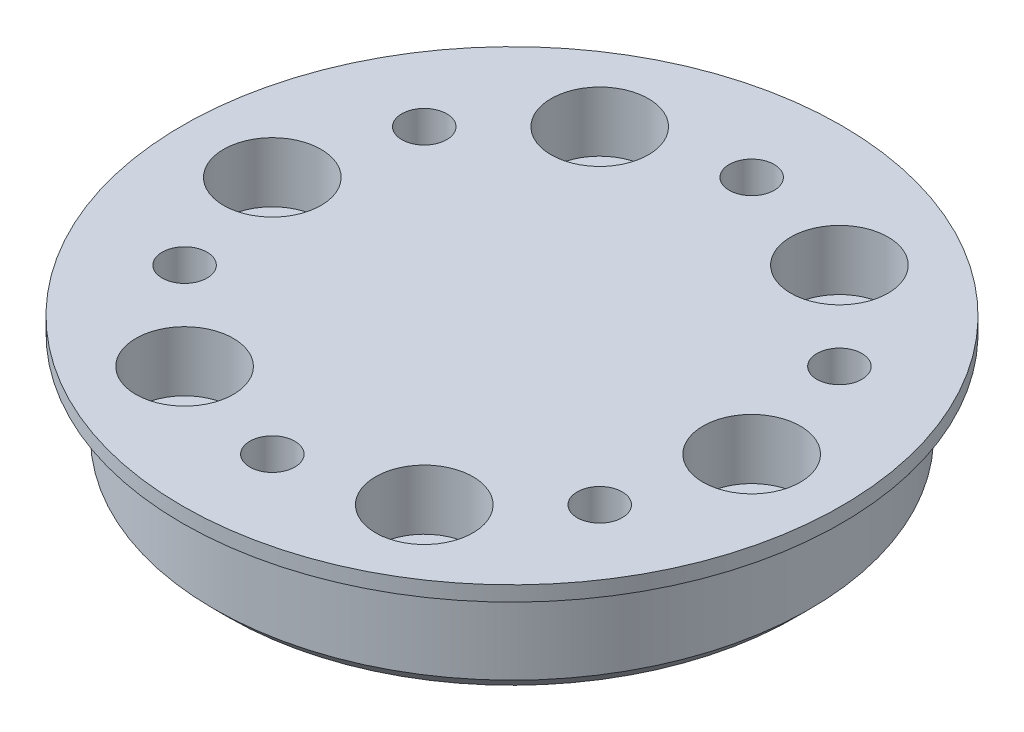
ISO-10303-21;
HEADER;
FILE_DESCRIPTION(('STEP AP214'),'2;1');
FILE_NAME('part.step','',(''),(''),'','','');
FILE_SCHEMA(('AUTOMOTIVE_DESIGN { 1 0 10303 214 1 1 1 1 }'));
ENDSEC;
DATA;
#1=APPLICATION_CONTEXT('core data for automotive mechanical design processes');
#2=APPLICATION_PROTOCOL_DEFINITION('international standard','automotive_design',2000,#1);
#3=PRODUCT_CONTEXT('',#1,'mechanical');
#4=PRODUCT('Part','Part','',(#3));
#5=PRODUCT_RELATED_PRODUCT_CATEGORY('part','',(#4));
#6=PRODUCT_DEFINITION_FORMATION('','',#4);
#7=PRODUCT_DEFINITION_CONTEXT('part definition',#1,'design');
#8=PRODUCT_DEFINITION('design','',#6,#7);
#9=PRODUCT_DEFINITION_SHAPE('','',#8);
#10=(LENGTH_UNIT() NAMED_UNIT(*) SI_UNIT(.MILLI.,.METRE.));
#11=(NAMED_UNIT(*) PLANE_ANGLE_UNIT() SI_UNIT($,.RADIAN.));
#12=(NAMED_UNIT(*) SI_UNIT($,.STERADIAN.) SOLID_ANGLE_UNIT());
#13=UNCERTAINTY_MEASURE_WITH_UNIT(LENGTH_MEASURE(1.E-05),#10,'distance_accuracy_value','');
#14=(GEOMETRIC_REPRESENTATION_CONTEXT(3) GLOBAL_UNCERTAINTY_ASSIGNED_CONTEXT((#13)) GLOBAL_UNIT_ASSIGNED_CONTEXT((#10,
#11,#12)) REPRESENTATION_CONTEXT('',''));
#15=CARTESIAN_POINT('',(0.,0.,0.));
#16=DIRECTION('',(0.,0.,1.));
#17=DIRECTION('',(1.,0.,0.));
#18=AXIS2_PLACEMENT_3D('',#15,#16,#17);
#19=CARTESIAN_POINT('',(8.00000000000002,0.,-13.856406460551));
#20=DIRECTION('',(0.,1.,0.));
#21=DIRECTION('',(0.,0.,1.));
#22=AXIS2_PLACEMENT_3D('',#19,#20,#21);
#23=CYLINDRICAL_SURFACE('',#22,1.6);
#24=CARTESIAN_POINT('',(8.00000000000002,0.,-13.856406460551));
#25=DIRECTION('',(0.,1.,0.));
#26=DIRECTION('',(0.,0.,1.));
#27=AXIS2_PLACEMENT_3D('',#24,#25,#26);
#28=CIRCLE('',#27,1.6);
#29=CARTESIAN_POINT('',(8.00000000000002,0.,-12.256406460551));
#30=VERTEX_POINT('',#29);
#31=EDGE_CURVE('E64',#30,#30,#28,.T.);
#32=ORIENTED_EDGE('',*,*,#31,.F.);
#33=EDGE_LOOP('',(#32));
#34=FACE_BOUND('',#33,.T.);
#35=CARTESIAN_POINT('',(8.00000000000002,4.,-13.856406460551));
#36=DIRECTION('',(0.,1.,0.));
#37=DIRECTION('',(0.,0.,1.));
#38=AXIS2_PLACEMENT_3D('',#35,#36,#37);
#39=CIRCLE('',#38,1.6);
#40=CARTESIAN_POINT('',(8.00000000000002,4.,-12.256406460551));
#41=VERTEX_POINT('',#40);
#42=EDGE_CURVE('E61',#41,#41,#39,.F.);
#43=ORIENTED_EDGE('',*,*,#42,.F.);
#44=EDGE_LOOP('',(#43));
#45=FACE_BOUND('',#44,.T.);
#46=ADVANCED_FACE('F42',(#34,#45),#23,.F.);
#47=CARTESIAN_POINT('',(16.0000000000007,0.,-6.79181874011743E-13));
#48=DIRECTION('',(0.,1.,0.));
#49=DIRECTION('',(0.,0.,1.));
#50=AXIS2_PLACEMENT_3D('',#47,#48,#49);
#51=CYLINDRICAL_SURFACE('',#50,1.6);
#52=CARTESIAN_POINT('',(16.0000000000007,0.,-6.79181874011743E-13));
#53=DIRECTION('',(0.,1.,0.));
#54=DIRECTION('',(0.,0.,1.));
#55=AXIS2_PLACEMENT_3D('',#52,#53,#54);
#56=CIRCLE('',#55,1.6);
#57=CARTESIAN_POINT('',(16.0000000000007,0.,1.59999999999932));
#58=VERTEX_POINT('',#57);
#59=EDGE_CURVE('E134',#58,#58,#56,.T.);
#60=ORIENTED_EDGE('',*,*,#59,.F.);
#61=EDGE_LOOP('',(#60));
#62=FACE_BOUND('',#61,.T.);
#63=CARTESIAN_POINT('',(16.0000000000007,4.,-6.79181874011743E-13));
#64=DIRECTION('',(0.,1.,0.));
#65=DIRECTION('',(0.,0.,1.));
#66=AXIS2_PLACEMENT_3D('',#63,#64,#65);
#67=CIRCLE('',#66,1.6);
#68=CARTESIAN_POINT('',(16.0000000000007,4.,1.59999999999932));
#69=VERTEX_POINT('',#68);
#70=EDGE_CURVE('E65',#69,#69,#67,.F.);
#71=ORIENTED_EDGE('',*,*,#70,.F.);
#72=EDGE_LOOP('',(#71));
#73=FACE_BOUND('',#72,.T.);
#74=ADVANCED_FACE('F217',(#62,#73),#51,.F.);
#75=CARTESIAN_POINT('',(8.00000000000127,0.,13.8564064605507));
#76=DIRECTION('',(0.,1.,0.));
#77=DIRECTION('',(0.,0.,1.));
#78=AXIS2_PLACEMENT_3D('',#75,#76,#77);
#79=CYLINDRICAL_SURFACE('',#78,1.6);
#80=CARTESIAN_POINT('',(8.00000000000127,0.,13.8564064605507));
#81=DIRECTION('',(0.,1.,0.));
#82=DIRECTION('',(0.,0.,1.));
#83=AXIS2_PLACEMENT_3D('',#80,#81,#82);
#84=CIRCLE('',#83,1.6);
#85=CARTESIAN_POINT('',(8.00000000000127,0.,15.4564064605507));
#86=VERTEX_POINT('',#85);
#87=EDGE_CURVE('E129',#86,#86,#84,.T.);
#88=ORIENTED_EDGE('',*,*,#87,.F.);
#89=EDGE_LOOP('',(#88));
#90=FACE_BOUND('',#89,.T.);
#91=CARTESIAN_POINT('',(8.00000000000127,4.,13.8564064605507));
#92=DIRECTION('',(0.,1.,0.));
#93=DIRECTION('',(0.,0.,1.));
#94=AXIS2_PLACEMENT_3D('',#91,#92,#93);
#95=CIRCLE('',#94,1.6);
#96=CARTESIAN_POINT('',(8.00000000000127,4.,15.4564064605507));
#97=VERTEX_POINT('',#96);
#98=EDGE_CURVE('E68',#97,#97,#95,.F.);
#99=ORIENTED_EDGE('',*,*,#98,.F.);
#100=EDGE_LOOP('',(#99));
#101=FACE_BOUND('',#100,.T.);
#102=ADVANCED_FACE('F223',(#90,#101),#79,.F.);
#103=CARTESIAN_POINT('',(-7.99999999999992,0.,-13.8564064605507));
#104=DIRECTION('',(0.,1.,0.));
#105=DIRECTION('',(0.,0.,1.));
#106=AXIS2_PLACEMENT_3D('',#103,#104,#105);
#107=CYLINDRICAL_SURFACE('',#106,1.6);
#108=CARTESIAN_POINT('',(-7.99999999999992,0.,-13.8564064605507));
#109=DIRECTION('',(0.,1.,0.));
#110=DIRECTION('',(0.,0.,1.));
#111=AXIS2_PLACEMENT_3D('',#108,#109,#110);
#112=CIRCLE('',#111,1.6);
#113=CARTESIAN_POINT('',(-7.99999999999992,0.,-12.2564064605507));
#114=VERTEX_POINT('',#113);
#115=EDGE_CURVE('E90',#114,#114,#112,.T.);
#116=ORIENTED_EDGE('',*,*,#115,.F.);
#117=EDGE_LOOP('',(#116));
#118=FACE_BOUND('',#117,.T.);
#119=CARTESIAN_POINT('',(-7.99999999999992,4.,-13.8564064605507));
#120=DIRECTION('',(0.,1.,0.));
#121=DIRECTION('',(0.,0.,1.));
#122=AXIS2_PLACEMENT_3D('',#119,#120,#121);
#123=CIRCLE('',#122,1.6);
#124=CARTESIAN_POINT('',(-7.99999999999992,4.,-12.2564064605507));
#125=VERTEX_POINT('',#124);
#126=EDGE_CURVE('E71',#125,#125,#123,.F.);
#127=ORIENTED_EDGE('',*,*,#126,.F.);
#128=EDGE_LOOP('',(#127));
#129=FACE_BOUND('',#128,.T.);
#130=ADVANCED_FACE('F238',(#118,#129),#107,.F.);
#131=CARTESIAN_POINT('',(-7.99999999999873,0.,13.8564064605514));
#132=DIRECTION('',(0.,1.,0.));
#133=DIRECTION('',(0.,0.,1.));
#134=AXIS2_PLACEMENT_3D('',#131,#132,#133);
#135=CYLINDRICAL_SURFACE('',#134,1.6);
#136=CARTESIAN_POINT('',(-7.99999999999873,0.,13.8564064605514));
#137=DIRECTION('',(0.,1.,0.));
#138=DIRECTION('',(0.,0.,1.));
#139=AXIS2_PLACEMENT_3D('',#136,#137,#138);
#140=CIRCLE('',#139,1.6);
#141=CARTESIAN_POINT('',(-7.99999999999873,0.,15.4564064605514));
#142=VERTEX_POINT('',#141);
#143=EDGE_CURVE('E126',#142,#142,#140,.T.);
#144=ORIENTED_EDGE('',*,*,#143,.F.);
#145=EDGE_LOOP('',(#144));
#146=FACE_BOUND('',#145,.T.);
#147=CARTESIAN_POINT('',(-7.99999999999873,4.,13.8564064605514));
#148=DIRECTION('',(0.,1.,0.));
#149=DIRECTION('',(0.,0.,1.));
#150=AXIS2_PLACEMENT_3D('',#147,#148,#149);
#151=CIRCLE('',#150,1.6);
#152=CARTESIAN_POINT('',(-7.99999999999873,4.,15.4564064605514));
#153=VERTEX_POINT('',#152);
#154=EDGE_CURVE('E74',#153,#153,#151,.F.);
#155=ORIENTED_EDGE('',*,*,#154,.F.);
#156=EDGE_LOOP('',(#155));
#157=FACE_BOUND('',#156,.T.);
#158=ADVANCED_FACE('F234',(#146,#157),#135,.F.);
#159=CARTESIAN_POINT('',(-15.9999999999993,0.,6.81141308890378E-13));
#160=DIRECTION('',(0.,1.,0.));
#161=DIRECTION('',(0.,0.,1.));
#162=AXIS2_PLACEMENT_3D('',#159,#160,#161);
#163=CYLINDRICAL_SURFACE('',#162,1.6);
#164=CARTESIAN_POINT('',(-15.9999999999993,0.,6.81141308890378E-13));
#165=DIRECTION('',(0.,1.,0.));
#166=DIRECTION('',(0.,0.,1.));
#167=AXIS2_PLACEMENT_3D('',#164,#165,#166);
#168=CIRCLE('',#167,1.6);
#169=CARTESIAN_POINT('',(-15.9999999999993,0.,1.60000000000068));
#170=VERTEX_POINT('',#169);
#171=EDGE_CURVE('E118',#170,#170,#168,.T.);
#172=ORIENTED_EDGE('',*,*,#171,.F.);
#173=EDGE_LOOP('',(#172));
#174=FACE_BOUND('',#173,.T.);
#175=CARTESIAN_POINT('',(-15.9999999999993,4.,6.81141308890378E-13));
#176=DIRECTION('',(0.,1.,0.));
#177=DIRECTION('',(0.,0.,1.));
#178=AXIS2_PLACEMENT_3D('',#175,#176,#177);
#179=CIRCLE('',#178,1.6);
#180=CARTESIAN_POINT('',(-15.9999999999993,4.,1.60000000000068));
#181=VERTEX_POINT('',#180);
#182=EDGE_CURVE('E77',#181,#181,#179,.F.);
#183=ORIENTED_EDGE('',*,*,#182,.F.);
#184=EDGE_LOOP('',(#183));
#185=FACE_BOUND('',#184,.T.);
#186=ADVANCED_FACE('F230',(#174,#185),#163,.F.);
#187=CARTESIAN_POINT('',(0.,7.,0.));
#188=DIRECTION('',(0.,-1.,0.));
#189=DIRECTION('',(0.,0.,-1.));
#190=AXIS2_PLACEMENT_3D('',#187,#188,#189);
#191=CYLINDRICAL_SURFACE('',#190,19.9);
#192=CARTESIAN_POINT('',(0.,1.,0.));
#193=DIRECTION('',(0.,1.,0.));
#194=DIRECTION('',(0.,0.,1.));
#195=AXIS2_PLACEMENT_3D('',#192,#193,#194);
#196=CIRCLE('',#195,19.9);
#197=CARTESIAN_POINT('',(0.,1.,19.9));
#198=VERTEX_POINT('',#197);
#199=EDGE_CURVE('E50',#198,#198,#196,.T.);
#200=ORIENTED_EDGE('',*,*,#199,.T.);
#201=EDGE_LOOP('',(#200));
#202=FACE_BOUND('',#201,.T.);
#203=CARTESIAN_POINT('',(0.,7.,0.));
#204=DIRECTION('',(0.,1.,0.));
#205=DIRECTION('',(0.,0.,1.));
#206=AXIS2_PLACEMENT_3D('',#203,#204,#205);
#207=CIRCLE('',#206,19.9);
#208=CARTESIAN_POINT('',(0.,7.,19.9));
#209=VERTEX_POINT('',#208);
#210=EDGE_CURVE('E54',#209,#209,#207,.T.);
#211=ORIENTED_EDGE('',*,*,#210,.F.);
#212=EDGE_LOOP('',(#211));
#213=FACE_BOUND('',#212,.T.);
#214=ADVANCED_FACE('F233',(#202,#213),#191,.T.);
#215=CARTESIAN_POINT('',(0.,0.,0.));
#216=DIRECTION('',(0.,1.,0.));
#217=DIRECTION('',(0.,0.,1.));
#218=AXIS2_PLACEMENT_3D('',#215,#216,#217);
#219=PLANE('',#218);
#220=CARTESIAN_POINT('',(0.,0.,0.));
#221=DIRECTION('',(0.,1.,0.));
#222=DIRECTION('',(0.,0.,1.));
#223=AXIS2_PLACEMENT_3D('',#220,#221,#222);
#224=CIRCLE('',#223,18.9);
#225=CARTESIAN_POINT('',(0.,0.,18.9));
#226=VERTEX_POINT('',#225);
#227=EDGE_CURVE('E10',#226,#226,#224,.F.);
#228=ORIENTED_EDGE('',*,*,#227,.T.);
#229=EDGE_LOOP('',(#228));
#230=FACE_BOUND('',#229,.T.);
#231=CARTESIAN_POINT('',(-13.85640646055,0.,8.0000000000006));
#232=DIRECTION('',(0.,1.,0.));
#233=DIRECTION('',(0.,0.,1.));
#234=AXIS2_PLACEMENT_3D('',#231,#232,#233);
#235=CIRCLE('',#234,1.5);
#236=CARTESIAN_POINT('',(-13.85640646055,0.,9.5000000000006));
#237=VERTEX_POINT('',#236);
#238=EDGE_CURVE('E121',#237,#237,#235,.T.);
#239=ORIENTED_EDGE('',*,*,#238,.T.);
#240=EDGE_LOOP('',(#239));
#241=FACE_BOUND('',#240,.T.);
#242=CARTESIAN_POINT('',(-13.8564064605507,0.,-7.9999999999994));
#243=DIRECTION('',(0.,1.,0.));
#244=DIRECTION('',(0.,0.,1.));
#245=AXIS2_PLACEMENT_3D('',#242,#243,#244);
#246=CIRCLE('',#245,1.5);
#247=CARTESIAN_POINT('',(-13.8564064605507,0.,-6.4999999999994));
#248=VERTEX_POINT('',#247);
#249=EDGE_CURVE('E114',#248,#248,#246,.T.);
#250=ORIENTED_EDGE('',*,*,#249,.T.);
#251=EDGE_LOOP('',(#250));
#252=FACE_BOUND('',#251,.T.);
#253=ORIENTED_EDGE('',*,*,#171,.T.);
#254=EDGE_LOOP('',(#253));
#255=FACE_BOUND('',#254,.T.);
#256=ORIENTED_EDGE('',*,*,#143,.T.);
#257=EDGE_LOOP('',(#256));
#258=FACE_BOUND('',#257,.T.);
#259=CARTESIAN_POINT('',(1.35836374802349E-12,0.,16.));
#260=DIRECTION('',(0.,1.,0.));
#261=DIRECTION('',(0.,0.,1.));
#262=AXIS2_PLACEMENT_3D('',#259,#260,#261);
#263=CIRCLE('',#262,1.5);
#264=CARTESIAN_POINT('',(1.35836374802349E-12,0.,17.5));
#265=VERTEX_POINT('',#264);
#266=EDGE_CURVE('E93',#265,#265,#263,.T.);
#267=ORIENTED_EDGE('',*,*,#266,.T.);
#268=EDGE_LOOP('',(#267));
#269=FACE_BOUND('',#268,.T.);
#270=CARTESIAN_POINT('',(13.856406460552,0.,7.99999999999941));
#271=DIRECTION('',(0.,1.,0.));
#272=DIRECTION('',(0.,0.,1.));
#273=AXIS2_PLACEMENT_3D('',#270,#271,#272);
#274=CIRCLE('',#273,1.5);
#275=CARTESIAN_POINT('',(13.856406460552,0.,9.49999999999941));
#276=VERTEX_POINT('',#275);
#277=EDGE_CURVE('E100',#276,#276,#274,.T.);
#278=ORIENTED_EDGE('',*,*,#277,.T.);
#279=EDGE_LOOP('',(#278));
#280=FACE_BOUND('',#279,.T.);
#281=CARTESIAN_POINT('',(13.8564064605514,0.,-8.00000000000059));
#282=DIRECTION('',(0.,1.,0.));
#283=DIRECTION('',(0.,0.,1.));
#284=AXIS2_PLACEMENT_3D('',#281,#282,#283);
#285=CIRCLE('',#284,1.5);
#286=CARTESIAN_POINT('',(13.8564064605514,0.,-6.50000000000059));
#287=VERTEX_POINT('',#286);
#288=EDGE_CURVE('E106',#287,#287,#285,.T.);
#289=ORIENTED_EDGE('',*,*,#288,.T.);
#290=EDGE_LOOP('',(#289));
#291=FACE_BOUND('',#290,.T.);
#292=ORIENTED_EDGE('',*,*,#115,.T.);
#293=EDGE_LOOP('',(#292));
#294=FACE_BOUND('',#293,.T.);
#295=ORIENTED_EDGE('',*,*,#87,.T.);
#296=EDGE_LOOP('',(#295));
#297=FACE_BOUND('',#296,.T.);
#298=ORIENTED_EDGE('',*,*,#59,.T.);
#299=EDGE_LOOP('',(#298));
#300=FACE_BOUND('',#299,.T.);
#301=ORIENTED_EDGE('',*,*,#31,.T.);
#302=EDGE_LOOP('',(#301));
#303=FACE_BOUND('',#302,.T.);
#304=CARTESIAN_POINT('',(0.,0.,-16.));
#305=DIRECTION('',(0.,1.,0.));
#306=DIRECTION('',(0.,0.,1.));
#307=AXIS2_PLACEMENT_3D('',#304,#305,#306);
#308=CIRCLE('',#307,1.5);
#309=CARTESIAN_POINT('',(0.,0.,-14.5));
#310=VERTEX_POINT('',#309);
#311=EDGE_CURVE('E84',#310,#310,#308,.T.);
#312=ORIENTED_EDGE('',*,*,#311,.T.);
#313=EDGE_LOOP('',(#312));
#314=FACE_BOUND('',#313,.T.);
#315=ADVANCED_FACE('F202',(#230,#241,#252,#255,#258,#269,#280,#291,#294,#297,#300,#303,#314),
#219,.F.);
#316=CARTESIAN_POINT('',(0.,8.,0.));
#317=DIRECTION('',(0.,-1.,0.));
#318=DIRECTION('',(0.,0.,-1.));
#319=AXIS2_PLACEMENT_3D('',#316,#317,#318);
#320=CYLINDRICAL_SURFACE('',#319,22.);
#321=CARTESIAN_POINT('',(0.,8.,0.));
#322=DIRECTION('',(0.,1.,0.));
#323=DIRECTION('',(0.,0.,1.));
#324=AXIS2_PLACEMENT_3D('',#321,#322,#323);
#325=CIRCLE('',#324,22.);
#326=CARTESIAN_POINT('',(0.,8.,22.));
#327=VERTEX_POINT('',#326);
#328=EDGE_CURVE('E58',#327,#327,#325,.T.);
#329=ORIENTED_EDGE('',*,*,#328,.F.);
#330=EDGE_LOOP('',(#329));
#331=FACE_BOUND('',#330,.T.);
#332=CARTESIAN_POINT('',(0.,7.,0.));
#333=DIRECTION('',(0.,1.,0.));
#334=DIRECTION('',(0.,0.,1.));
#335=AXIS2_PLACEMENT_3D('',#332,#333,#334);
#336=CIRCLE('',#335,22.);
#337=CARTESIAN_POINT('',(0.,7.,22.));
#338=VERTEX_POINT('',#337);
#339=EDGE_CURVE('E81',#338,#338,#336,.T.);
#340=ORIENTED_EDGE('',*,*,#339,.T.);
#341=EDGE_LOOP('',(#340));
#342=FACE_BOUND('',#341,.T.);
#343=ADVANCED_FACE('F181',(#331,#342),#320,.T.);
#344=CARTESIAN_POINT('',(0.,8.,0.));
#345=DIRECTION('',(0.,1.,0.));
#346=DIRECTION('',(0.,0.,1.));
#347=AXIS2_PLACEMENT_3D('',#344,#345,#346);
#348=PLANE('',#347);
#349=CARTESIAN_POINT('',(-15.9999999999991,8.,4.60650117873576E-13));
#350=DIRECTION('',(0.,1.,0.));
#351=DIRECTION('',(0.,0.,1.));
#352=AXIS2_PLACEMENT_3D('',#349,#350,#351);
#353=CIRCLE('',#352,3.2500000000004);
#354=CARTESIAN_POINT('',(-15.9999999999991,8.,3.25000000000086));
#355=VERTEX_POINT('',#354);
#356=EDGE_CURVE('E148',#355,#355,#353,.T.);
#357=ORIENTED_EDGE('',*,*,#356,.F.);
#358=EDGE_LOOP('',(#357));
#359=FACE_BOUND('',#358,.T.);
#360=CARTESIAN_POINT('',(-7.99999999999856,8.,13.8564064605508));
#361=DIRECTION('',(0.,1.,0.));
#362=DIRECTION('',(0.,0.,1.));
#363=AXIS2_PLACEMENT_3D('',#360,#361,#362);
#364=CIRCLE('',#363,3.25000000000102);
#365=CARTESIAN_POINT('',(-7.99999999999856,8.,17.1064064605518));
#366=VERTEX_POINT('',#365);
#367=EDGE_CURVE('E154',#366,#366,#364,.T.);
#368=ORIENTED_EDGE('',*,*,#367,.F.);
#369=EDGE_LOOP('',(#368));
#370=FACE_BOUND('',#369,.T.);
#371=CARTESIAN_POINT('',(8.00000000000111,8.,13.85640646055));
#372=DIRECTION('',(0.,1.,0.));
#373=DIRECTION('',(0.,0.,1.));
#374=AXIS2_PLACEMENT_3D('',#371,#372,#373);
#375=CIRCLE('',#374,3.25000000000144);
#376=CARTESIAN_POINT('',(8.00000000000111,8.,17.1064064605515));
#377=VERTEX_POINT('',#376);
#378=EDGE_CURVE('E160',#377,#377,#375,.T.);
#379=ORIENTED_EDGE('',*,*,#378,.F.);
#380=EDGE_LOOP('',(#379));
#381=FACE_BOUND('',#380,.T.);
#382=CARTESIAN_POINT('',(16.0000000000003,8.,-1.11811031526879E-12));
#383=DIRECTION('',(0.,1.,0.));
#384=DIRECTION('',(0.,0.,1.));
#385=AXIS2_PLACEMENT_3D('',#382,#383,#384);
#386=CIRCLE('',#385,3.2500000000012);
#387=CARTESIAN_POINT('',(16.0000000000003,8.,3.25000000000008));
#388=VERTEX_POINT('',#387);
#389=EDGE_CURVE('E166',#388,#388,#386,.T.);
#390=ORIENTED_EDGE('',*,*,#389,.F.);
#391=EDGE_LOOP('',(#390));
#392=FACE_BOUND('',#391,.T.);
#393=CARTESIAN_POINT('',(7.99999999999975,8.,-13.8564064605515));
#394=DIRECTION('',(0.,1.,0.));
#395=DIRECTION('',(0.,0.,1.));
#396=AXIS2_PLACEMENT_3D('',#393,#394,#395);
#397=CIRCLE('',#396,3.2500000000005);
#398=CARTESIAN_POINT('',(7.99999999999975,8.,-10.606406460551));
#399=VERTEX_POINT('',#398);
#400=EDGE_CURVE('E142',#399,#399,#397,.T.);
#401=ORIENTED_EDGE('',*,*,#400,.F.);
#402=EDGE_LOOP('',(#401));
#403=FACE_BOUND('',#402,.T.);
#404=CARTESIAN_POINT('',(-7.99999999999992,8.,-13.8564064605507));
#405=DIRECTION('',(0.,1.,0.));
#406=DIRECTION('',(0.,0.,1.));
#407=AXIS2_PLACEMENT_3D('',#404,#405,#406);
#408=CIRCLE('',#407,3.25);
#409=CARTESIAN_POINT('',(-7.99999999999992,8.,-10.6064064605507));
#410=VERTEX_POINT('',#409);
#411=EDGE_CURVE('E139',#410,#410,#408,.T.);
#412=ORIENTED_EDGE('',*,*,#411,.F.);
#413=EDGE_LOOP('',(#412));
#414=FACE_BOUND('',#413,.T.);
#415=CARTESIAN_POINT('',(-13.85640646055,8.,8.0000000000006));
#416=DIRECTION('',(0.,1.,0.));
#417=DIRECTION('',(0.,0.,1.));
#418=AXIS2_PLACEMENT_3D('',#415,#416,#417);
#419=CIRCLE('',#418,1.5);
#420=CARTESIAN_POINT('',(-13.85640646055,8.,9.5000000000006));
#421=VERTEX_POINT('',#420);
#422=EDGE_CURVE('E97',#421,#421,#419,.T.);
#423=ORIENTED_EDGE('',*,*,#422,.F.);
#424=EDGE_LOOP('',(#423));
#425=FACE_BOUND('',#424,.T.);
#426=CARTESIAN_POINT('',(-13.8564064605507,8.,-7.9999999999994));
#427=DIRECTION('',(0.,1.,0.));
#428=DIRECTION('',(0.,0.,1.));
#429=AXIS2_PLACEMENT_3D('',#426,#427,#428);
#430=CIRCLE('',#429,1.5);
#431=CARTESIAN_POINT('',(-13.8564064605507,8.,-6.4999999999994));
#432=VERTEX_POINT('',#431);
#433=EDGE_CURVE('E117',#432,#432,#430,.T.);
#434=ORIENTED_EDGE('',*,*,#433,.F.);
#435=EDGE_LOOP('',(#434));
#436=FACE_BOUND('',#435,.T.);
#437=CARTESIAN_POINT('',(1.35836374802349E-12,8.,16.));
#438=DIRECTION('',(0.,1.,0.));
#439=DIRECTION('',(0.,0.,1.));
#440=AXIS2_PLACEMENT_3D('',#437,#438,#439);
#441=CIRCLE('',#440,1.5);
#442=CARTESIAN_POINT('',(1.35836374802349E-12,8.,17.5));
#443=VERTEX_POINT('',#442);
#444=EDGE_CURVE('E96',#443,#443,#441,.T.);
#445=ORIENTED_EDGE('',*,*,#444,.F.);
#446=EDGE_LOOP('',(#445));
#447=FACE_BOUND('',#446,.T.);
#448=CARTESIAN_POINT('',(13.856406460552,8.,7.99999999999941));
#449=DIRECTION('',(0.,1.,0.));
#450=DIRECTION('',(0.,0.,1.));
#451=AXIS2_PLACEMENT_3D('',#448,#449,#450);
#452=CIRCLE('',#451,1.5);
#453=CARTESIAN_POINT('',(13.856406460552,8.,9.49999999999941));
#454=VERTEX_POINT('',#453);
#455=EDGE_CURVE('E103',#454,#454,#452,.T.);
#456=ORIENTED_EDGE('',*,*,#455,.F.);
#457=EDGE_LOOP('',(#456));
#458=FACE_BOUND('',#457,.T.);
#459=CARTESIAN_POINT('',(13.8564064605514,8.,-8.00000000000059));
#460=DIRECTION('',(0.,1.,0.));
#461=DIRECTION('',(0.,0.,1.));
#462=AXIS2_PLACEMENT_3D('',#459,#460,#461);
#463=CIRCLE('',#462,1.5);
#464=CARTESIAN_POINT('',(13.8564064605514,8.,-6.50000000000059));
#465=VERTEX_POINT('',#464);
#466=EDGE_CURVE('E109',#465,#465,#463,.T.);
#467=ORIENTED_EDGE('',*,*,#466,.F.);
#468=EDGE_LOOP('',(#467));
#469=FACE_BOUND('',#468,.T.);
#470=CARTESIAN_POINT('',(0.,8.,-16.));
#471=DIRECTION('',(0.,1.,0.));
#472=DIRECTION('',(0.,0.,1.));
#473=AXIS2_PLACEMENT_3D('',#470,#471,#472);
#474=CIRCLE('',#473,1.5);
#475=CARTESIAN_POINT('',(0.,8.,-14.5));
#476=VERTEX_POINT('',#475);
#477=EDGE_CURVE('E87',#476,#476,#474,.T.);
#478=ORIENTED_EDGE('',*,*,#477,.F.);
#479=EDGE_LOOP('',(#478));
#480=FACE_BOUND('',#479,.T.);
#481=ORIENTED_EDGE('',*,*,#328,.T.);
#482=EDGE_LOOP('',(#481));
#483=FACE_BOUND('',#482,.T.);
#484=ADVANCED_FACE('F177',(#359,#370,#381,#392,#403,#414,#425,#436,#447,#458,#469,#480,#483),
#348,.T.);
#485=CARTESIAN_POINT('',(0.,7.,0.));
#486=DIRECTION('',(0.,1.,0.));
#487=DIRECTION('',(0.,0.,1.));
#488=AXIS2_PLACEMENT_3D('',#485,#486,#487);
#489=PLANE('',#488);
#490=ORIENTED_EDGE('',*,*,#210,.T.);
#491=EDGE_LOOP('',(#490));
#492=FACE_BOUND('',#491,.T.);
#493=ORIENTED_EDGE('',*,*,#339,.F.);
#494=EDGE_LOOP('',(#493));
#495=FACE_BOUND('',#494,.T.);
#496=ADVANCED_FACE('F180',(#492,#495),#489,.F.);
#497=CARTESIAN_POINT('',(0.,0.,-16.));
#498=DIRECTION('',(0.,1.,0.));
#499=DIRECTION('',(0.,0.,1.));
#500=AXIS2_PLACEMENT_3D('',#497,#498,#499);
#501=CYLINDRICAL_SURFACE('',#500,1.5);
#502=ORIENTED_EDGE('',*,*,#311,.F.);
#503=EDGE_LOOP('',(#502));
#504=FACE_BOUND('',#503,.T.);
#505=ORIENTED_EDGE('',*,*,#477,.T.);
#506=EDGE_LOOP('',(#505));
#507=FACE_BOUND('',#506,.T.);
#508=ADVANCED_FACE('F207',(#504,#507),#501,.F.);
#509=CARTESIAN_POINT('',(13.8564064605514,0.,-8.00000000000059));
#510=DIRECTION('',(0.,1.,0.));
#511=DIRECTION('',(0.,0.,1.));
#512=AXIS2_PLACEMENT_3D('',#509,#510,#511);
#513=CYLINDRICAL_SURFACE('',#512,1.5);
#514=ORIENTED_EDGE('',*,*,#288,.F.);
#515=EDGE_LOOP('',(#514));
#516=FACE_BOUND('',#515,.T.);
#517=ORIENTED_EDGE('',*,*,#466,.T.);
#518=EDGE_LOOP('',(#517));
#519=FACE_BOUND('',#518,.T.);
#520=ADVANCED_FACE('F213',(#516,#519),#513,.F.);
#521=CARTESIAN_POINT('',(13.856406460552,0.,7.99999999999941));
#522=DIRECTION('',(0.,1.,0.));
#523=DIRECTION('',(0.,0.,1.));
#524=AXIS2_PLACEMENT_3D('',#521,#522,#523);
#525=CYLINDRICAL_SURFACE('',#524,1.5);
#526=ORIENTED_EDGE('',*,*,#277,.F.);
#527=EDGE_LOOP('',(#526));
#528=FACE_BOUND('',#527,.T.);
#529=ORIENTED_EDGE('',*,*,#455,.T.);
#530=EDGE_LOOP('',(#529));
#531=FACE_BOUND('',#530,.T.);
#532=ADVANCED_FACE('F255',(#528,#531),#525,.F.);
#533=CARTESIAN_POINT('',(1.35836374802349E-12,0.,16.));
#534=DIRECTION('',(0.,1.,0.));
#535=DIRECTION('',(0.,0.,1.));
#536=AXIS2_PLACEMENT_3D('',#533,#534,#535);
#537=CYLINDRICAL_SURFACE('',#536,1.5);
#538=ORIENTED_EDGE('',*,*,#266,.F.);
#539=EDGE_LOOP('',(#538));
#540=FACE_BOUND('',#539,.T.);
#541=ORIENTED_EDGE('',*,*,#444,.T.);
#542=EDGE_LOOP('',(#541));
#543=FACE_BOUND('',#542,.T.);
#544=ADVANCED_FACE('F248',(#540,#543),#537,.F.);
#545=CARTESIAN_POINT('',(-13.8564064605507,0.,-7.9999999999994));
#546=DIRECTION('',(0.,1.,0.));
#547=DIRECTION('',(0.,0.,1.));
#548=AXIS2_PLACEMENT_3D('',#545,#546,#547);
#549=CYLINDRICAL_SURFACE('',#548,1.5);
#550=ORIENTED_EDGE('',*,*,#249,.F.);
#551=EDGE_LOOP('',(#550));
#552=FACE_BOUND('',#551,.T.);
#553=ORIENTED_EDGE('',*,*,#433,.T.);
#554=EDGE_LOOP('',(#553));
#555=FACE_BOUND('',#554,.T.);
#556=ADVANCED_FACE('F244',(#552,#555),#549,.F.);
#557=CARTESIAN_POINT('',(-13.85640646055,0.,8.0000000000006));
#558=DIRECTION('',(0.,1.,0.));
#559=DIRECTION('',(0.,0.,1.));
#560=AXIS2_PLACEMENT_3D('',#557,#558,#559);
#561=CYLINDRICAL_SURFACE('',#560,1.5);
#562=ORIENTED_EDGE('',*,*,#238,.F.);
#563=EDGE_LOOP('',(#562));
#564=FACE_BOUND('',#563,.T.);
#565=ORIENTED_EDGE('',*,*,#422,.T.);
#566=EDGE_LOOP('',(#565));
#567=FACE_BOUND('',#566,.T.);
#568=ADVANCED_FACE('F240',(#564,#567),#561,.F.);
#569=CARTESIAN_POINT('',(-15.9999999999991,4.,4.60650117873576E-13));
#570=DIRECTION('',(0.,1.,0.));
#571=DIRECTION('',(0.,0.,1.));
#572=AXIS2_PLACEMENT_3D('',#569,#570,#571);
#573=PLANE('',#572);
#574=CARTESIAN_POINT('',(-15.9999999999991,4.,4.60650117873576E-13));
#575=DIRECTION('',(0.,1.,0.));
#576=DIRECTION('',(0.,0.,1.));
#577=AXIS2_PLACEMENT_3D('',#574,#575,#576);
#578=CIRCLE('',#577,3.2500000000004);
#579=CARTESIAN_POINT('',(-15.9999999999991,4.,3.25000000000086));
#580=VERTEX_POINT('',#579);
#581=EDGE_CURVE('E145',#580,#580,#578,.T.);
#582=ORIENTED_EDGE('',*,*,#581,.T.);
#583=EDGE_LOOP('',(#582));
#584=FACE_BOUND('',#583,.T.);
#585=ORIENTED_EDGE('',*,*,#182,.T.);
#586=EDGE_LOOP('',(#585));
#587=FACE_BOUND('',#586,.T.);
#588=ADVANCED_FACE('F243',(#584,#587),#573,.T.);
#589=CARTESIAN_POINT('',(-15.9999999999991,4.,4.60650117873576E-13));
#590=DIRECTION('',(0.,1.,0.));
#591=DIRECTION('',(0.,0.,1.));
#592=AXIS2_PLACEMENT_3D('',#589,#590,#591);
#593=CYLINDRICAL_SURFACE('',#592,3.2500000000004);
#594=ORIENTED_EDGE('',*,*,#581,.F.);
#595=EDGE_LOOP('',(#594));
#596=FACE_BOUND('',#595,.T.);
#597=ORIENTED_EDGE('',*,*,#356,.T.);
#598=EDGE_LOOP('',(#597));
#599=FACE_BOUND('',#598,.T.);
#600=ADVANCED_FACE('F316',(#596,#599),#593,.F.);
#601=CARTESIAN_POINT('',(-7.99999999999856,4.,13.8564064605508));
#602=DIRECTION('',(0.,1.,0.));
#603=DIRECTION('',(0.,0.,1.));
#604=AXIS2_PLACEMENT_3D('',#601,#602,#603);
#605=PLANE('',#604);
#606=CARTESIAN_POINT('',(-7.99999999999856,4.,13.8564064605508));
#607=DIRECTION('',(0.,1.,0.));
#608=DIRECTION('',(0.,0.,1.));
#609=AXIS2_PLACEMENT_3D('',#606,#607,#608);
#610=CIRCLE('',#609,3.25000000000102);
#611=CARTESIAN_POINT('',(-7.99999999999856,4.,17.1064064605518));
#612=VERTEX_POINT('',#611);
#613=EDGE_CURVE('E151',#612,#612,#610,.T.);
#614=ORIENTED_EDGE('',*,*,#613,.T.);
#615=EDGE_LOOP('',(#614));
#616=FACE_BOUND('',#615,.T.);
#617=ORIENTED_EDGE('',*,*,#154,.T.);
#618=EDGE_LOOP('',(#617));
#619=FACE_BOUND('',#618,.T.);
#620=ADVANCED_FACE('F312',(#616,#619),#605,.T.);
#621=CARTESIAN_POINT('',(-7.99999999999856,4.,13.8564064605508));
#622=DIRECTION('',(0.,1.,0.));
#623=DIRECTION('',(0.,0.,1.));
#624=AXIS2_PLACEMENT_3D('',#621,#622,#623);
#625=CYLINDRICAL_SURFACE('',#624,3.25000000000102);
#626=ORIENTED_EDGE('',*,*,#613,.F.);
#627=EDGE_LOOP('',(#626));
#628=FACE_BOUND('',#627,.T.);
#629=ORIENTED_EDGE('',*,*,#367,.T.);
#630=EDGE_LOOP('',(#629));
#631=FACE_BOUND('',#630,.T.);
#632=ADVANCED_FACE('F308',(#628,#631),#625,.F.);
#633=CARTESIAN_POINT('',(-7.99999999999992,4.,-13.8564064605507));
#634=DIRECTION('',(0.,1.,0.));
#635=DIRECTION('',(0.,0.,1.));
#636=AXIS2_PLACEMENT_3D('',#633,#634,#635);
#637=PLANE('',#636);
#638=CARTESIAN_POINT('',(-7.99999999999992,4.,-13.8564064605507));
#639=DIRECTION('',(0.,1.,0.));
#640=DIRECTION('',(0.,0.,1.));
#641=AXIS2_PLACEMENT_3D('',#638,#639,#640);
#642=CIRCLE('',#641,3.25);
#643=CARTESIAN_POINT('',(-7.99999999999992,4.,-10.6064064605507));
#644=VERTEX_POINT('',#643);
#645=EDGE_CURVE('E79',#644,#644,#642,.T.);
#646=ORIENTED_EDGE('',*,*,#645,.T.);
#647=EDGE_LOOP('',(#646));
#648=FACE_BOUND('',#647,.T.);
#649=ORIENTED_EDGE('',*,*,#126,.T.);
#650=EDGE_LOOP('',(#649));
#651=FACE_BOUND('',#650,.T.);
#652=ADVANCED_FACE('F311',(#648,#651),#637,.T.);
#653=CARTESIAN_POINT('',(-7.99999999999992,4.,-13.8564064605507));
#654=DIRECTION('',(0.,1.,0.));
#655=DIRECTION('',(0.,0.,1.));
#656=AXIS2_PLACEMENT_3D('',#653,#654,#655);
#657=CYLINDRICAL_SURFACE('',#656,3.25);
#658=ORIENTED_EDGE('',*,*,#645,.F.);
#659=EDGE_LOOP('',(#658));
#660=FACE_BOUND('',#659,.T.);
#661=ORIENTED_EDGE('',*,*,#411,.T.);
#662=EDGE_LOOP('',(#661));
#663=FACE_BOUND('',#662,.T.);
#664=ADVANCED_FACE('F306',(#660,#663),#657,.F.);
#665=CARTESIAN_POINT('',(8.00000000000111,4.,13.85640646055));
#666=DIRECTION('',(0.,1.,0.));
#667=DIRECTION('',(0.,0.,1.));
#668=AXIS2_PLACEMENT_3D('',#665,#666,#667);
#669=PLANE('',#668);
#670=CARTESIAN_POINT('',(8.00000000000111,4.,13.85640646055));
#671=DIRECTION('',(0.,1.,0.));
#672=DIRECTION('',(0.,0.,1.));
#673=AXIS2_PLACEMENT_3D('',#670,#671,#672);
#674=CIRCLE('',#673,3.25000000000144);
#675=CARTESIAN_POINT('',(8.00000000000111,4.,17.1064064605515));
#676=VERTEX_POINT('',#675);
#677=EDGE_CURVE('E157',#676,#676,#674,.T.);
#678=ORIENTED_EDGE('',*,*,#677,.T.);
#679=EDGE_LOOP('',(#678));
#680=FACE_BOUND('',#679,.T.);
#681=ORIENTED_EDGE('',*,*,#98,.T.);
#682=EDGE_LOOP('',(#681));
#683=FACE_BOUND('',#682,.T.);
#684=ADVANCED_FACE('F299',(#680,#683),#669,.T.);
#685=CARTESIAN_POINT('',(8.00000000000111,4.,13.85640646055));
#686=DIRECTION('',(0.,1.,0.));
#687=DIRECTION('',(0.,0.,1.));
#688=AXIS2_PLACEMENT_3D('',#685,#686,#687);
#689=CYLINDRICAL_SURFACE('',#688,3.25000000000144);
#690=ORIENTED_EDGE('',*,*,#677,.F.);
#691=EDGE_LOOP('',(#690));
#692=FACE_BOUND('',#691,.T.);
#693=ORIENTED_EDGE('',*,*,#378,.T.);
#694=EDGE_LOOP('',(#693));
#695=FACE_BOUND('',#694,.T.);
#696=ADVANCED_FACE('F289',(#692,#695),#689,.F.);
#697=CARTESIAN_POINT('',(16.0000000000003,4.,-1.11811031526879E-12));
#698=DIRECTION('',(0.,1.,0.));
#699=DIRECTION('',(0.,0.,1.));
#700=AXIS2_PLACEMENT_3D('',#697,#698,#699);
#701=PLANE('',#700);
#702=CARTESIAN_POINT('',(16.0000000000003,4.,-1.11811031526879E-12));
#703=DIRECTION('',(0.,1.,0.));
#704=DIRECTION('',(0.,0.,1.));
#705=AXIS2_PLACEMENT_3D('',#702,#703,#704);
#706=CIRCLE('',#705,3.2500000000012);
#707=CARTESIAN_POINT('',(16.0000000000003,4.,3.25000000000008));
#708=VERTEX_POINT('',#707);
#709=EDGE_CURVE('E163',#708,#708,#706,.T.);
#710=ORIENTED_EDGE('',*,*,#709,.T.);
#711=EDGE_LOOP('',(#710));
#712=FACE_BOUND('',#711,.T.);
#713=ORIENTED_EDGE('',*,*,#70,.T.);
#714=EDGE_LOOP('',(#713));
#715=FACE_BOUND('',#714,.T.);
#716=ADVANCED_FACE('F286',(#712,#715),#701,.T.);
#717=CARTESIAN_POINT('',(16.0000000000003,4.,-1.11811031526879E-12));
#718=DIRECTION('',(0.,1.,0.));
#719=DIRECTION('',(0.,0.,1.));
#720=AXIS2_PLACEMENT_3D('',#717,#718,#719);
#721=CYLINDRICAL_SURFACE('',#720,3.2500000000012);
#722=ORIENTED_EDGE('',*,*,#709,.F.);
#723=EDGE_LOOP('',(#722));
#724=FACE_BOUND('',#723,.T.);
#725=ORIENTED_EDGE('',*,*,#389,.T.);
#726=EDGE_LOOP('',(#725));
#727=FACE_BOUND('',#726,.T.);
#728=ADVANCED_FACE('F288',(#724,#727),#721,.F.);
#729=CARTESIAN_POINT('',(7.99999999999975,4.,-13.8564064605515));
#730=DIRECTION('',(0.,1.,0.));
#731=DIRECTION('',(0.,0.,1.));
#732=AXIS2_PLACEMENT_3D('',#729,#730,#731);
#733=PLANE('',#732);
#734=CARTESIAN_POINT('',(7.99999999999975,4.,-13.8564064605515));
#735=DIRECTION('',(0.,1.,0.));
#736=DIRECTION('',(0.,0.,1.));
#737=AXIS2_PLACEMENT_3D('',#734,#735,#736);
#738=CIRCLE('',#737,3.2500000000005);
#739=CARTESIAN_POINT('',(7.99999999999975,4.,-10.606406460551));
#740=VERTEX_POINT('',#739);
#741=EDGE_CURVE('E169',#740,#740,#738,.T.);
#742=ORIENTED_EDGE('',*,*,#741,.T.);
#743=EDGE_LOOP('',(#742));
#744=FACE_BOUND('',#743,.T.);
#745=ORIENTED_EDGE('',*,*,#42,.T.);
#746=EDGE_LOOP('',(#745));
#747=FACE_BOUND('',#746,.T.);
#748=ADVANCED_FACE('F296',(#744,#747),#733,.T.);
#749=CARTESIAN_POINT('',(7.99999999999975,4.,-13.8564064605515));
#750=DIRECTION('',(0.,1.,0.));
#751=DIRECTION('',(0.,0.,1.));
#752=AXIS2_PLACEMENT_3D('',#749,#750,#751);
#753=CYLINDRICAL_SURFACE('',#752,3.2500000000005);
#754=ORIENTED_EDGE('',*,*,#741,.F.);
#755=EDGE_LOOP('',(#754));
#756=FACE_BOUND('',#755,.T.);
#757=ORIENTED_EDGE('',*,*,#400,.T.);
#758=EDGE_LOOP('',(#757));
#759=FACE_BOUND('',#758,.T.);
#760=ADVANCED_FACE('F175',(#756,#759),#753,.F.);
#761=CARTESIAN_POINT('',(0.,1.,0.));
#762=DIRECTION('',(0.,1.,0.));
#763=DIRECTION('',(0.,0.,1.));
#764=AXIS2_PLACEMENT_3D('',#761,#762,#763);
#765=CONICAL_SURFACE('',#764,19.9,0.785398163397452);
#766=ORIENTED_EDGE('',*,*,#227,.F.);
#767=EDGE_LOOP('',(#766));
#768=FACE_BOUND('',#767,.T.);
#769=ORIENTED_EDGE('',*,*,#199,.F.);
#770=EDGE_LOOP('',(#769));
#771=FACE_BOUND('',#770,.T.);
#772=ADVANCED_FACE('F45',(#768,#771),#765,.T.);
#773=CLOSED_SHELL('',(#46,#74,#102,#130,#158,#186,#214,#315,#343,#484,#496,#508,#520,#532,#544,
#556,#568,#588,#600,#620,#632,#652,#664,#684,#696,#716,#728,#748,#760,#772));
#774=MANIFOLD_SOLID_BREP('B2',#773);
#775=ADVANCED_BREP_SHAPE_REPRESENTATION('',(#18,#774),#14);
#776=SHAPE_DEFINITION_REPRESENTATION(#9,#775);
ENDSEC;
END-ISO-10303-21;
